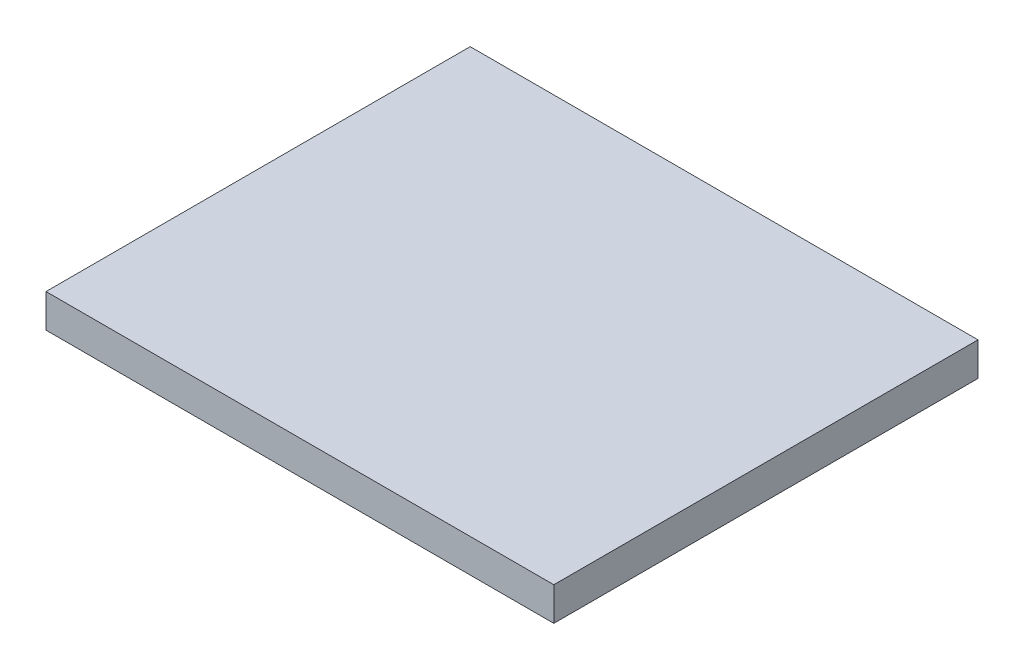
ISO-10303-21;
HEADER;
FILE_DESCRIPTION(('STEP AP214'),'2;1');
FILE_NAME('part.step','',(''),(''),'','','');
FILE_SCHEMA(('AUTOMOTIVE_DESIGN { 1 0 10303 214 1 1 1 1 }'));
ENDSEC;
DATA;
#1=APPLICATION_CONTEXT('core data for automotive mechanical design processes');
#2=APPLICATION_PROTOCOL_DEFINITION('international standard','automotive_design',2000,#1);
#3=PRODUCT_CONTEXT('',#1,'mechanical');
#4=PRODUCT('Part','Part','',(#3));
#5=PRODUCT_RELATED_PRODUCT_CATEGORY('part','',(#4));
#6=PRODUCT_DEFINITION_FORMATION('','',#4);
#7=PRODUCT_DEFINITION_CONTEXT('part definition',#1,'design');
#8=PRODUCT_DEFINITION('design','',#6,#7);
#9=PRODUCT_DEFINITION_SHAPE('','',#8);
#10=(LENGTH_UNIT() NAMED_UNIT(*) SI_UNIT(.MILLI.,.METRE.));
#11=(NAMED_UNIT(*) PLANE_ANGLE_UNIT() SI_UNIT($,.RADIAN.));
#12=(NAMED_UNIT(*) SI_UNIT($,.STERADIAN.) SOLID_ANGLE_UNIT());
#13=UNCERTAINTY_MEASURE_WITH_UNIT(LENGTH_MEASURE(1.E-05),#10,'distance_accuracy_value','');
#14=(GEOMETRIC_REPRESENTATION_CONTEXT(3) GLOBAL_UNCERTAINTY_ASSIGNED_CONTEXT((#13)) GLOBAL_UNIT_ASSIGNED_CONTEXT((#10,
#11,#12)) REPRESENTATION_CONTEXT('',''));
#15=CARTESIAN_POINT('',(0.,0.,0.));
#16=DIRECTION('',(0.,0.,1.));
#17=DIRECTION('',(1.,0.,0.));
#18=AXIS2_PLACEMENT_3D('',#15,#16,#17);
#19=CARTESIAN_POINT('',(-7.6928176563692,0.56,-3.42611325697532));
#20=DIRECTION('',(1.,0.,0.));
#21=DIRECTION('',(0.,0.,-1.));
#22=AXIS2_PLACEMENT_3D('',#19,#20,#21);
#23=PLANE('',#22);
#24=DIRECTION('',(0.,0.,1.));
#25=VECTOR('',#24,1.);
#26=CARTESIAN_POINT('',(-7.6928176563692,0.,-3.42611325697532));
#27=LINE('',#26,#25);
#28=CARTESIAN_POINT('',(-7.6928176563692,0.,-3.42611325697532));
#29=VERTEX_POINT('',#28);
#30=CARTESIAN_POINT('',(-7.6928176563692,0.,3.67388674302468));
#31=VERTEX_POINT('',#30);
#32=EDGE_CURVE('E104',#29,#31,#27,.T.);
#33=ORIENTED_EDGE('',*,*,#32,.T.);
#34=DIRECTION('',(0.,-1.,0.));
#35=VECTOR('',#34,1.);
#36=CARTESIAN_POINT('',(-7.6928176563692,0.56,3.67388674302468));
#37=LINE('',#36,#35);
#38=CARTESIAN_POINT('',(-7.6928176563692,0.56,3.67388674302468));
#39=VERTEX_POINT('',#38);
#40=EDGE_CURVE('E11',#39,#31,#37,.T.);
#41=ORIENTED_EDGE('',*,*,#40,.F.);
#42=DIRECTION('',(0.,0.,1.));
#43=VECTOR('',#42,1.);
#44=CARTESIAN_POINT('',(-7.6928176563692,0.56,-3.42611325697532));
#45=LINE('',#44,#43);
#46=CARTESIAN_POINT('',(-7.6928176563692,0.56,-3.42611325697532));
#47=VERTEX_POINT('',#46);
#48=EDGE_CURVE('E92',#47,#39,#45,.T.);
#49=ORIENTED_EDGE('',*,*,#48,.F.);
#50=DIRECTION('',(0.,-1.,0.));
#51=VECTOR('',#50,1.);
#52=CARTESIAN_POINT('',(-7.6928176563692,0.56,-3.42611325697532));
#53=LINE('',#52,#51);
#54=EDGE_CURVE('E100',#47,#29,#53,.T.);
#55=ORIENTED_EDGE('',*,*,#54,.T.);
#56=EDGE_LOOP('',(#33,#41,#49,#55));
#57=FACE_BOUND('',#56,.T.);
#58=ADVANCED_FACE('F41',(#57),#23,.F.);
#59=CARTESIAN_POINT('',(-7.6928176563692,0.56,3.67388674302468));
#60=DIRECTION('',(0.,0.,-1.));
#61=DIRECTION('',(-1.,0.,0.));
#62=AXIS2_PLACEMENT_3D('',#59,#60,#61);
#63=PLANE('',#62);
#64=DIRECTION('',(1.,0.,0.));
#65=VECTOR('',#64,1.);
#66=CARTESIAN_POINT('',(-7.6928176563692,0.,3.67388674302468));
#67=LINE('',#66,#65);
#68=CARTESIAN_POINT('',(0.807182343630801,0.,3.67388674302468));
#69=VERTEX_POINT('',#68);
#70=EDGE_CURVE('E96',#31,#69,#67,.T.);
#71=ORIENTED_EDGE('',*,*,#70,.T.);
#72=DIRECTION('',(0.,-1.,0.));
#73=VECTOR('',#72,1.);
#74=CARTESIAN_POINT('',(0.807182343630801,0.56,3.67388674302468));
#75=LINE('',#74,#73);
#76=CARTESIAN_POINT('',(0.807182343630801,0.56,3.67388674302468));
#77=VERTEX_POINT('',#76);
#78=EDGE_CURVE('E49',#77,#69,#75,.T.);
#79=ORIENTED_EDGE('',*,*,#78,.F.);
#80=DIRECTION('',(1.,0.,0.));
#81=VECTOR('',#80,1.);
#82=CARTESIAN_POINT('',(-7.6928176563692,0.56,3.67388674302468));
#83=LINE('',#82,#81);
#84=EDGE_CURVE('E87',#39,#77,#83,.T.);
#85=ORIENTED_EDGE('',*,*,#84,.F.);
#86=ORIENTED_EDGE('',*,*,#40,.T.);
#87=EDGE_LOOP('',(#71,#79,#85,#86));
#88=FACE_BOUND('',#87,.T.);
#89=ADVANCED_FACE('F95',(#88),#63,.F.);
#90=CARTESIAN_POINT('',(0.807182343630801,0.56,-3.42611325697532));
#91=DIRECTION('',(-1.,0.,0.));
#92=DIRECTION('',(0.,0.,1.));
#93=AXIS2_PLACEMENT_3D('',#90,#91,#92);
#94=PLANE('',#93);
#95=DIRECTION('',(0.,0.,-1.));
#96=VECTOR('',#95,1.);
#97=CARTESIAN_POINT('',(0.807182343630801,0.,-3.42611325697532));
#98=LINE('',#97,#96);
#99=CARTESIAN_POINT('',(0.807182343630801,0.,-3.42611325697532));
#100=VERTEX_POINT('',#99);
#101=EDGE_CURVE('E74',#69,#100,#98,.T.);
#102=ORIENTED_EDGE('',*,*,#101,.T.);
#103=DIRECTION('',(0.,-1.,0.));
#104=VECTOR('',#103,1.);
#105=CARTESIAN_POINT('',(0.807182343630801,0.56,-3.42611325697532));
#106=LINE('',#105,#104);
#107=CARTESIAN_POINT('',(0.807182343630801,0.56,-3.42611325697532));
#108=VERTEX_POINT('',#107);
#109=EDGE_CURVE('E97',#108,#100,#106,.T.);
#110=ORIENTED_EDGE('',*,*,#109,.F.);
#111=DIRECTION('',(0.,0.,-1.));
#112=VECTOR('',#111,1.);
#113=CARTESIAN_POINT('',(0.807182343630801,0.56,-3.42611325697532));
#114=LINE('',#113,#112);
#115=EDGE_CURVE('E90',#77,#108,#114,.T.);
#116=ORIENTED_EDGE('',*,*,#115,.F.);
#117=ORIENTED_EDGE('',*,*,#78,.T.);
#118=EDGE_LOOP('',(#102,#110,#116,#117));
#119=FACE_BOUND('',#118,.T.);
#120=ADVANCED_FACE('F98',(#119),#94,.F.);
#121=CARTESIAN_POINT('',(-7.6928176563692,0.56,-3.42611325697532));
#122=DIRECTION('',(0.,0.,1.));
#123=DIRECTION('',(1.,0.,0.));
#124=AXIS2_PLACEMENT_3D('',#121,#122,#123);
#125=PLANE('',#124);
#126=DIRECTION('',(-1.,0.,0.));
#127=VECTOR('',#126,1.);
#128=CARTESIAN_POINT('',(-7.6928176563692,0.,-3.42611325697532));
#129=LINE('',#128,#127);
#130=EDGE_CURVE('E80',#100,#29,#129,.T.);
#131=ORIENTED_EDGE('',*,*,#130,.T.);
#132=ORIENTED_EDGE('',*,*,#54,.F.);
#133=DIRECTION('',(-1.,0.,0.));
#134=VECTOR('',#133,1.);
#135=CARTESIAN_POINT('',(-7.6928176563692,0.56,-3.42611325697532));
#136=LINE('',#135,#134);
#137=EDGE_CURVE('E57',#108,#47,#136,.T.);
#138=ORIENTED_EDGE('',*,*,#137,.F.);
#139=ORIENTED_EDGE('',*,*,#109,.T.);
#140=EDGE_LOOP('',(#131,#132,#138,#139));
#141=FACE_BOUND('',#140,.T.);
#142=ADVANCED_FACE('F111',(#141),#125,.F.);
#143=CARTESIAN_POINT('',(0.,0.56,0.));
#144=DIRECTION('',(0.,1.,0.));
#145=DIRECTION('',(0.,0.,1.));
#146=AXIS2_PLACEMENT_3D('',#143,#144,#145);
#147=PLANE('',#146);
#148=ORIENTED_EDGE('',*,*,#48,.T.);
#149=ORIENTED_EDGE('',*,*,#84,.T.);
#150=ORIENTED_EDGE('',*,*,#115,.T.);
#151=ORIENTED_EDGE('',*,*,#137,.T.);
#152=EDGE_LOOP('',(#148,#149,#150,#151));
#153=FACE_BOUND('',#152,.T.);
#154=ADVANCED_FACE('F88',(#153),#147,.T.);
#155=CARTESIAN_POINT('',(0.,0.,0.));
#156=DIRECTION('',(0.,1.,0.));
#157=DIRECTION('',(0.,0.,1.));
#158=AXIS2_PLACEMENT_3D('',#155,#156,#157);
#159=PLANE('',#158);
#160=ORIENTED_EDGE('',*,*,#32,.F.);
#161=ORIENTED_EDGE('',*,*,#130,.F.);
#162=ORIENTED_EDGE('',*,*,#101,.F.);
#163=ORIENTED_EDGE('',*,*,#70,.F.);
#164=EDGE_LOOP('',(#160,#161,#162,#163));
#165=FACE_BOUND('',#164,.T.);
#166=ADVANCED_FACE('F114',(#165),#159,.F.);
#167=CLOSED_SHELL('',(#58,#89,#120,#142,#154,#166));
#168=MANIFOLD_SOLID_BREP('B2',#167);
#169=ADVANCED_BREP_SHAPE_REPRESENTATION('',(#18,#168),#14);
#170=SHAPE_DEFINITION_REPRESENTATION(#9,#169);
ENDSEC;
END-ISO-10303-21;
